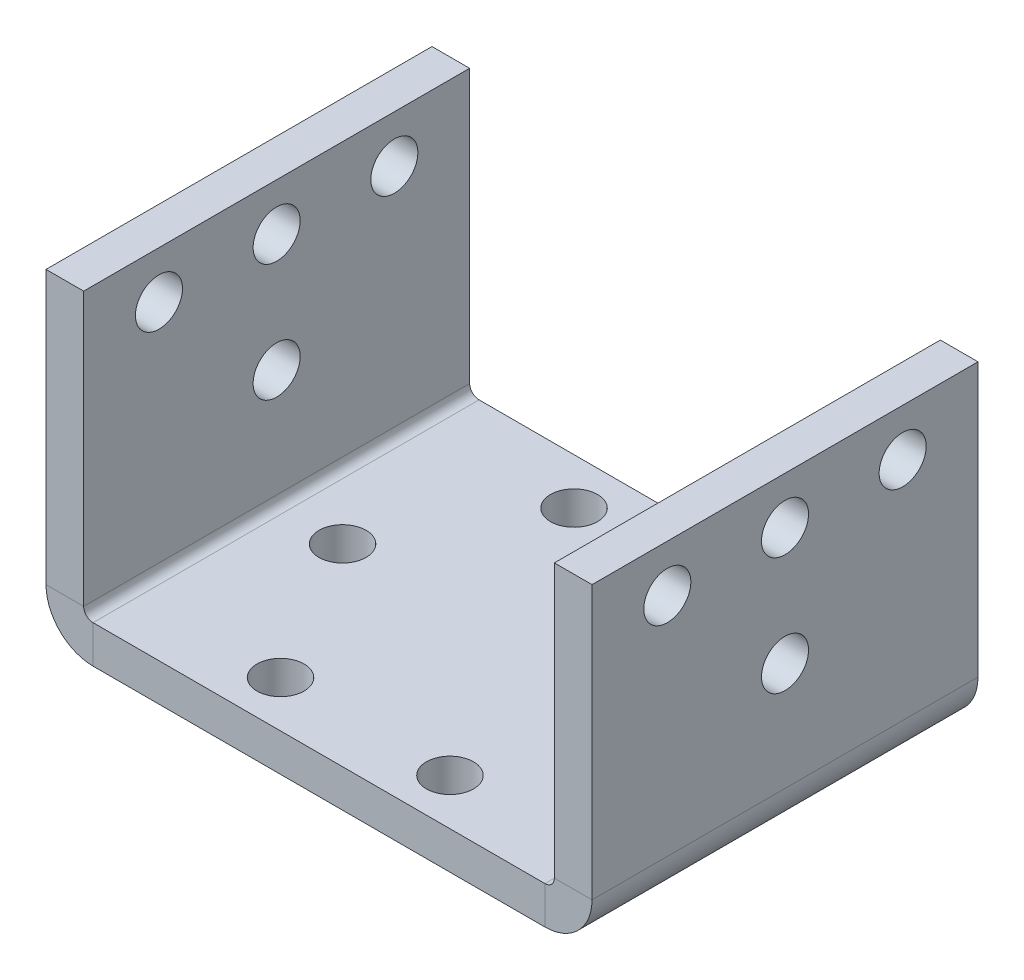
ISO-10303-21;
HEADER;
FILE_DESCRIPTION(('STEP AP214'),'2;1');
FILE_NAME('part.step','',(''),(''),'','','');
FILE_SCHEMA(('AUTOMOTIVE_DESIGN { 1 0 10303 214 1 1 1 1 }'));
ENDSEC;
DATA;
#1=APPLICATION_CONTEXT('core data for automotive mechanical design processes');
#2=APPLICATION_PROTOCOL_DEFINITION('international standard','automotive_design',2000,#1);
#3=PRODUCT_CONTEXT('',#1,'mechanical');
#4=PRODUCT('Part','Part','',(#3));
#5=PRODUCT_RELATED_PRODUCT_CATEGORY('part','',(#4));
#6=PRODUCT_DEFINITION_FORMATION('','',#4);
#7=PRODUCT_DEFINITION_CONTEXT('part definition',#1,'design');
#8=PRODUCT_DEFINITION('design','',#6,#7);
#9=PRODUCT_DEFINITION_SHAPE('','',#8);
#10=(LENGTH_UNIT() NAMED_UNIT(*) SI_UNIT(.MILLI.,.METRE.));
#11=(NAMED_UNIT(*) PLANE_ANGLE_UNIT() SI_UNIT($,.RADIAN.));
#12=(NAMED_UNIT(*) SI_UNIT($,.STERADIAN.) SOLID_ANGLE_UNIT());
#13=UNCERTAINTY_MEASURE_WITH_UNIT(LENGTH_MEASURE(1.E-05),#10,'distance_accuracy_value','');
#14=(GEOMETRIC_REPRESENTATION_CONTEXT(3) GLOBAL_UNCERTAINTY_ASSIGNED_CONTEXT((#13)) GLOBAL_UNIT_ASSIGNED_CONTEXT((#10,
#11,#12)) REPRESENTATION_CONTEXT('',''));
#15=CARTESIAN_POINT('',(0.,0.,0.));
#16=DIRECTION('',(0.,0.,1.));
#17=DIRECTION('',(1.,0.,0.));
#18=AXIS2_PLACEMENT_3D('',#15,#16,#17);
#19=CARTESIAN_POINT('',(25.,1.00000000000001,41.));
#20=DIRECTION('',(0.,0.,1.));
#21=DIRECTION('',(1.,0.,0.));
#22=AXIS2_PLACEMENT_3D('',#19,#20,#21);
#23=PLANE('',#22);
#24=DIRECTION('',(1.,0.,0.));
#25=VECTOR('',#24,1.);
#26=CARTESIAN_POINT('',(25.,1.00000000000001,41.));
#27=LINE('',#26,#25);
#28=CARTESIAN_POINT('',(25.,1.00000000000001,41.));
#29=VERTEX_POINT('',#28);
#30=CARTESIAN_POINT('',(29.,1.00000000000001,41.));
#31=VERTEX_POINT('',#30);
#32=EDGE_CURVE('E11',#29,#31,#27,.T.);
#33=ORIENTED_EDGE('',*,*,#32,.F.);
#34=CARTESIAN_POINT('',(24.,1.00000000000001,41.));
#35=DIRECTION('',(0.,0.,1.));
#36=DIRECTION('',(1.,0.,0.));
#37=AXIS2_PLACEMENT_3D('',#34,#35,#36);
#38=CIRCLE('',#37,1.);
#39=CARTESIAN_POINT('',(24.,0.,41.));
#40=VERTEX_POINT('',#39);
#41=EDGE_CURVE('E151',#29,#40,#38,.F.);
#42=ORIENTED_EDGE('',*,*,#41,.T.);
#43=DIRECTION('',(0.,1.,0.));
#44=VECTOR('',#43,1.);
#45=CARTESIAN_POINT('',(24.,-3.99999999999999,41.));
#46=LINE('',#45,#44);
#47=CARTESIAN_POINT('',(24.,-3.99999999999999,41.));
#48=VERTEX_POINT('',#47);
#49=EDGE_CURVE('E47',#48,#40,#46,.T.);
#50=ORIENTED_EDGE('',*,*,#49,.F.);
#51=CARTESIAN_POINT('',(24.,1.00000000000001,41.));
#52=DIRECTION('',(0.,0.,1.));
#53=DIRECTION('',(1.,0.,0.));
#54=AXIS2_PLACEMENT_3D('',#51,#52,#53);
#55=CIRCLE('',#54,5.);
#56=EDGE_CURVE('E320',#31,#48,#55,.F.);
#57=ORIENTED_EDGE('',*,*,#56,.F.);
#58=EDGE_LOOP('',(#33,#42,#50,#57));
#59=FACE_BOUND('',#58,.T.);
#60=ADVANCED_FACE('F38',(#59),#23,.T.);
#61=CARTESIAN_POINT('',(24.,-3.99999999999999,41.));
#62=DIRECTION('',(0.,0.,1.));
#63=DIRECTION('',(1.,0.,0.));
#64=AXIS2_PLACEMENT_3D('',#61,#62,#63);
#65=PLANE('',#64);
#66=DIRECTION('',(0.,-1.,0.));
#67=VECTOR('',#66,1.);
#68=CARTESIAN_POINT('',(25.,0.,41.));
#69=LINE('',#68,#67);
#70=CARTESIAN_POINT('',(25.,30.,41.));
#71=VERTEX_POINT('',#70);
#72=EDGE_CURVE('E156',#71,#29,#69,.T.);
#73=ORIENTED_EDGE('',*,*,#72,.T.);
#74=ORIENTED_EDGE('',*,*,#32,.T.);
#75=DIRECTION('',(0.,1.,0.));
#76=VECTOR('',#75,1.);
#77=CARTESIAN_POINT('',(29.,0.,41.));
#78=LINE('',#77,#76);
#79=CARTESIAN_POINT('',(29.,30.,41.));
#80=VERTEX_POINT('',#79);
#81=EDGE_CURVE('E322',#80,#31,#78,.F.);
#82=ORIENTED_EDGE('',*,*,#81,.F.);
#83=DIRECTION('',(1.,0.,0.));
#84=VECTOR('',#83,1.);
#85=CARTESIAN_POINT('',(25.,30.,41.));
#86=LINE('',#85,#84);
#87=EDGE_CURVE('E325',#71,#80,#86,.T.);
#88=ORIENTED_EDGE('',*,*,#87,.F.);
#89=EDGE_LOOP('',(#73,#74,#82,#88));
#90=FACE_BOUND('',#89,.T.);
#91=ADVANCED_FACE('F331',(#90),#65,.T.);
#92=CARTESIAN_POINT('',(24.,0.,0.));
#93=DIRECTION('',(0.,0.,-1.));
#94=DIRECTION('',(-1.,0.,0.));
#95=AXIS2_PLACEMENT_3D('',#92,#93,#94);
#96=PLANE('',#95);
#97=DIRECTION('',(0.,-1.,0.));
#98=VECTOR('',#97,1.);
#99=CARTESIAN_POINT('',(24.,0.,0.));
#100=LINE('',#99,#98);
#101=CARTESIAN_POINT('',(24.,0.,0.));
#102=VERTEX_POINT('',#101);
#103=CARTESIAN_POINT('',(24.,-3.99999999999999,0.));
#104=VERTEX_POINT('',#103);
#105=EDGE_CURVE('E148',#102,#104,#100,.T.);
#106=ORIENTED_EDGE('',*,*,#105,.F.);
#107=CARTESIAN_POINT('',(24.,1.00000000000001,0.));
#108=DIRECTION('',(0.,0.,1.));
#109=DIRECTION('',(1.,0.,0.));
#110=AXIS2_PLACEMENT_3D('',#107,#108,#109);
#111=CIRCLE('',#110,1.);
#112=CARTESIAN_POINT('',(25.,1.00000000000001,0.));
#113=VERTEX_POINT('',#112);
#114=EDGE_CURVE('E163',#113,#102,#111,.F.);
#115=ORIENTED_EDGE('',*,*,#114,.F.);
#116=DIRECTION('',(-1.,0.,0.));
#117=VECTOR('',#116,1.);
#118=CARTESIAN_POINT('',(29.,1.00000000000001,0.));
#119=LINE('',#118,#117);
#120=CARTESIAN_POINT('',(29.,1.00000000000001,0.));
#121=VERTEX_POINT('',#120);
#122=EDGE_CURVE('E237',#121,#113,#119,.T.);
#123=ORIENTED_EDGE('',*,*,#122,.F.);
#124=CARTESIAN_POINT('',(24.,1.00000000000001,0.));
#125=DIRECTION('',(0.,0.,1.));
#126=DIRECTION('',(1.,0.,0.));
#127=AXIS2_PLACEMENT_3D('',#124,#125,#126);
#128=CIRCLE('',#127,5.);
#129=EDGE_CURVE('E191',#121,#104,#128,.F.);
#130=ORIENTED_EDGE('',*,*,#129,.T.);
#131=EDGE_LOOP('',(#106,#115,#123,#130));
#132=FACE_BOUND('',#131,.T.);
#133=ADVANCED_FACE('F338',(#132),#96,.T.);
#134=CARTESIAN_POINT('',(29.,1.00000000000001,0.));
#135=DIRECTION('',(0.,0.,-1.));
#136=DIRECTION('',(-1.,0.,0.));
#137=AXIS2_PLACEMENT_3D('',#134,#135,#136);
#138=PLANE('',#137);
#139=DIRECTION('',(-1.,0.,0.));
#140=VECTOR('',#139,1.);
#141=CARTESIAN_POINT('',(-25.,0.,0.));
#142=LINE('',#141,#140);
#143=CARTESIAN_POINT('',(-24.,0.,0.));
#144=VERTEX_POINT('',#143);
#145=EDGE_CURVE('E204',#102,#144,#142,.T.);
#146=ORIENTED_EDGE('',*,*,#145,.F.);
#147=ORIENTED_EDGE('',*,*,#105,.T.);
#148=DIRECTION('',(-1.,0.,0.));
#149=VECTOR('',#148,1.);
#150=CARTESIAN_POINT('',(-25.,-4.,0.));
#151=LINE('',#150,#149);
#152=CARTESIAN_POINT('',(-24.,-4.,0.));
#153=VERTEX_POINT('',#152);
#154=EDGE_CURVE('E189',#104,#153,#151,.T.);
#155=ORIENTED_EDGE('',*,*,#154,.T.);
#156=DIRECTION('',(0.,1.,0.));
#157=VECTOR('',#156,1.);
#158=CARTESIAN_POINT('',(-24.,-4.,0.));
#159=LINE('',#158,#157);
#160=EDGE_CURVE('E97',#153,#144,#159,.T.);
#161=ORIENTED_EDGE('',*,*,#160,.T.);
#162=EDGE_LOOP('',(#146,#147,#155,#161));
#163=FACE_BOUND('',#162,.T.);
#164=ADVANCED_FACE('F340',(#163),#138,.T.);
#165=CARTESIAN_POINT('',(-24.,0.,41.));
#166=DIRECTION('',(0.,0.,1.));
#167=DIRECTION('',(1.,0.,0.));
#168=AXIS2_PLACEMENT_3D('',#165,#166,#167);
#169=PLANE('',#168);
#170=DIRECTION('',(0.,-1.,0.));
#171=VECTOR('',#170,1.);
#172=CARTESIAN_POINT('',(-24.,0.,41.));
#173=LINE('',#172,#171);
#174=CARTESIAN_POINT('',(-24.,0.,41.));
#175=VERTEX_POINT('',#174);
#176=CARTESIAN_POINT('',(-24.,-4.,41.));
#177=VERTEX_POINT('',#176);
#178=EDGE_CURVE('E235',#175,#177,#173,.T.);
#179=ORIENTED_EDGE('',*,*,#178,.F.);
#180=CARTESIAN_POINT('',(-24.,1.,41.));
#181=DIRECTION('',(0.,0.,1.));
#182=DIRECTION('',(1.,0.,0.));
#183=AXIS2_PLACEMENT_3D('',#180,#181,#182);
#184=CIRCLE('',#183,1.);
#185=CARTESIAN_POINT('',(-25.,1.,41.));
#186=VERTEX_POINT('',#185);
#187=EDGE_CURVE('E171',#175,#186,#184,.F.);
#188=ORIENTED_EDGE('',*,*,#187,.T.);
#189=DIRECTION('',(1.,0.,0.));
#190=VECTOR('',#189,1.);
#191=CARTESIAN_POINT('',(-29.,1.,41.));
#192=LINE('',#191,#190);
#193=CARTESIAN_POINT('',(-29.,1.,41.));
#194=VERTEX_POINT('',#193);
#195=EDGE_CURVE('E56',#194,#186,#192,.T.);
#196=ORIENTED_EDGE('',*,*,#195,.F.);
#197=CARTESIAN_POINT('',(-24.,1.,41.));
#198=DIRECTION('',(0.,0.,1.));
#199=DIRECTION('',(1.,0.,0.));
#200=AXIS2_PLACEMENT_3D('',#197,#198,#199);
#201=CIRCLE('',#200,5.);
#202=EDGE_CURVE('E316',#177,#194,#201,.F.);
#203=ORIENTED_EDGE('',*,*,#202,.F.);
#204=EDGE_LOOP('',(#179,#188,#196,#203));
#205=FACE_BOUND('',#204,.T.);
#206=ADVANCED_FACE('F390',(#205),#169,.T.);
#207=CARTESIAN_POINT('',(-29.,1.,41.));
#208=DIRECTION('',(0.,0.,1.));
#209=DIRECTION('',(1.,0.,0.));
#210=AXIS2_PLACEMENT_3D('',#207,#208,#209);
#211=PLANE('',#210);
#212=DIRECTION('',(-1.,0.,0.));
#213=VECTOR('',#212,1.);
#214=CARTESIAN_POINT('',(-25.,0.,41.));
#215=LINE('',#214,#213);
#216=EDGE_CURVE('E140',#40,#175,#215,.T.);
#217=ORIENTED_EDGE('',*,*,#216,.T.);
#218=ORIENTED_EDGE('',*,*,#178,.T.);
#219=DIRECTION('',(-1.,0.,0.));
#220=VECTOR('',#219,1.);
#221=CARTESIAN_POINT('',(-25.,-4.,41.));
#222=LINE('',#221,#220);
#223=EDGE_CURVE('E143',#48,#177,#222,.T.);
#224=ORIENTED_EDGE('',*,*,#223,.F.);
#225=ORIENTED_EDGE('',*,*,#49,.T.);
#226=EDGE_LOOP('',(#217,#218,#224,#225));
#227=FACE_BOUND('',#226,.T.);
#228=ADVANCED_FACE('F138',(#227),#211,.T.);
#229=CARTESIAN_POINT('',(-25.,1.,0.));
#230=DIRECTION('',(0.,0.,-1.));
#231=DIRECTION('',(-1.,0.,0.));
#232=AXIS2_PLACEMENT_3D('',#229,#230,#231);
#233=PLANE('',#232);
#234=DIRECTION('',(-1.,0.,0.));
#235=VECTOR('',#234,1.);
#236=CARTESIAN_POINT('',(-25.,1.,0.));
#237=LINE('',#236,#235);
#238=CARTESIAN_POINT('',(-25.,1.,0.));
#239=VERTEX_POINT('',#238);
#240=CARTESIAN_POINT('',(-29.,1.,0.));
#241=VERTEX_POINT('',#240);
#242=EDGE_CURVE('E104',#239,#241,#237,.T.);
#243=ORIENTED_EDGE('',*,*,#242,.F.);
#244=CARTESIAN_POINT('',(-24.,1.,0.));
#245=DIRECTION('',(0.,0.,1.));
#246=DIRECTION('',(1.,0.,0.));
#247=AXIS2_PLACEMENT_3D('',#244,#245,#246);
#248=CIRCLE('',#247,1.);
#249=EDGE_CURVE('E206',#144,#239,#248,.F.);
#250=ORIENTED_EDGE('',*,*,#249,.F.);
#251=ORIENTED_EDGE('',*,*,#160,.F.);
#252=CARTESIAN_POINT('',(-24.,1.,0.));
#253=DIRECTION('',(0.,0.,1.));
#254=DIRECTION('',(1.,0.,0.));
#255=AXIS2_PLACEMENT_3D('',#252,#253,#254);
#256=CIRCLE('',#255,5.);
#257=EDGE_CURVE('E187',#153,#241,#256,.F.);
#258=ORIENTED_EDGE('',*,*,#257,.T.);
#259=EDGE_LOOP('',(#243,#250,#251,#258));
#260=FACE_BOUND('',#259,.T.);
#261=ADVANCED_FACE('F353',(#260),#233,.T.);
#262=CARTESIAN_POINT('',(-24.,-4.,0.));
#263=DIRECTION('',(0.,0.,-1.));
#264=DIRECTION('',(-1.,0.,0.));
#265=AXIS2_PLACEMENT_3D('',#262,#263,#264);
#266=PLANE('',#265);
#267=DIRECTION('',(0.,1.,0.));
#268=VECTOR('',#267,1.);
#269=CARTESIAN_POINT('',(-25.,0.,0.));
#270=LINE('',#269,#268);
#271=CARTESIAN_POINT('',(-25.,30.,0.));
#272=VERTEX_POINT('',#271);
#273=EDGE_CURVE('E177',#239,#272,#270,.T.);
#274=ORIENTED_EDGE('',*,*,#273,.F.);
#275=ORIENTED_EDGE('',*,*,#242,.T.);
#276=DIRECTION('',(0.,1.,0.));
#277=VECTOR('',#276,1.);
#278=CARTESIAN_POINT('',(-29.,0.,0.));
#279=LINE('',#278,#277);
#280=CARTESIAN_POINT('',(-29.,30.,0.));
#281=VERTEX_POINT('',#280);
#282=EDGE_CURVE('E184',#241,#281,#279,.T.);
#283=ORIENTED_EDGE('',*,*,#282,.T.);
#284=DIRECTION('',(1.,0.,0.));
#285=VECTOR('',#284,1.);
#286=CARTESIAN_POINT('',(-29.,30.,0.));
#287=LINE('',#286,#285);
#288=EDGE_CURVE('E180',#281,#272,#287,.T.);
#289=ORIENTED_EDGE('',*,*,#288,.T.);
#290=EDGE_LOOP('',(#274,#275,#283,#289));
#291=FACE_BOUND('',#290,.T.);
#292=ADVANCED_FACE('F361',(#291),#266,.T.);
#293=CARTESIAN_POINT('',(-25.,0.,41.));
#294=DIRECTION('',(-1.,0.,0.));
#295=DIRECTION('',(0.,0.,1.));
#296=AXIS2_PLACEMENT_3D('',#293,#294,#295);
#297=PLANE('',#296);
#298=CARTESIAN_POINT('',(-25.,12.5,20.5));
#299=DIRECTION('',(-1.,0.,0.));
#300=DIRECTION('',(0.,0.,1.));
#301=AXIS2_PLACEMENT_3D('',#298,#299,#300);
#302=CIRCLE('',#301,2.5);
#303=CARTESIAN_POINT('',(-25.,12.5,23.));
#304=VERTEX_POINT('',#303);
#305=EDGE_CURVE('E289',#304,#304,#302,.T.);
#306=ORIENTED_EDGE('',*,*,#305,.T.);
#307=EDGE_LOOP('',(#306));
#308=FACE_BOUND('',#307,.T.);
#309=CARTESIAN_POINT('',(-25.,25.,33.));
#310=DIRECTION('',(-1.,0.,0.));
#311=DIRECTION('',(0.,0.,1.));
#312=AXIS2_PLACEMENT_3D('',#309,#310,#311);
#313=CIRCLE('',#312,2.5);
#314=CARTESIAN_POINT('',(-25.,25.,35.5));
#315=VERTEX_POINT('',#314);
#316=EDGE_CURVE('E274',#315,#315,#313,.T.);
#317=ORIENTED_EDGE('',*,*,#316,.T.);
#318=EDGE_LOOP('',(#317));
#319=FACE_BOUND('',#318,.T.);
#320=CARTESIAN_POINT('',(-25.,25.,20.5));
#321=DIRECTION('',(-1.,0.,0.));
#322=DIRECTION('',(0.,0.,1.));
#323=AXIS2_PLACEMENT_3D('',#320,#321,#322);
#324=CIRCLE('',#323,2.5);
#325=CARTESIAN_POINT('',(-25.,25.,23.));
#326=VERTEX_POINT('',#325);
#327=EDGE_CURVE('E270',#326,#326,#324,.T.);
#328=ORIENTED_EDGE('',*,*,#327,.T.);
#329=EDGE_LOOP('',(#328));
#330=FACE_BOUND('',#329,.T.);
#331=CARTESIAN_POINT('',(-25.,25.,8.));
#332=DIRECTION('',(-1.,0.,0.));
#333=DIRECTION('',(0.,0.,1.));
#334=AXIS2_PLACEMENT_3D('',#331,#332,#333);
#335=CIRCLE('',#334,2.5);
#336=CARTESIAN_POINT('',(-25.,25.,10.5));
#337=VERTEX_POINT('',#336);
#338=EDGE_CURVE('E266',#337,#337,#335,.T.);
#339=ORIENTED_EDGE('',*,*,#338,.T.);
#340=EDGE_LOOP('',(#339));
#341=FACE_BOUND('',#340,.T.);
#342=ORIENTED_EDGE('',*,*,#273,.T.);
#343=DIRECTION('',(0.,0.,-1.));
#344=VECTOR('',#343,1.);
#345=CARTESIAN_POINT('',(-25.,30.,41.));
#346=LINE('',#345,#344);
#347=CARTESIAN_POINT('',(-25.,30.,41.));
#348=VERTEX_POINT('',#347);
#349=EDGE_CURVE('E230',#348,#272,#346,.T.);
#350=ORIENTED_EDGE('',*,*,#349,.F.);
#351=DIRECTION('',(0.,1.,0.));
#352=VECTOR('',#351,1.);
#353=CARTESIAN_POINT('',(-25.,0.,41.));
#354=LINE('',#353,#352);
#355=EDGE_CURVE('E110',#186,#348,#354,.T.);
#356=ORIENTED_EDGE('',*,*,#355,.F.);
#357=DIRECTION('',(0.,0.,-1.));
#358=VECTOR('',#357,1.);
#359=CARTESIAN_POINT('',(-25.,1.,41.));
#360=LINE('',#359,#358);
#361=EDGE_CURVE('E173',#186,#239,#360,.T.);
#362=ORIENTED_EDGE('',*,*,#361,.T.);
#363=EDGE_LOOP('',(#342,#350,#356,#362));
#364=FACE_BOUND('',#363,.T.);
#365=ADVANCED_FACE('F359',(#308,#319,#330,#341,#364),#297,.F.);
#366=CARTESIAN_POINT('',(-29.,30.,41.));
#367=DIRECTION('',(0.,1.,0.));
#368=DIRECTION('',(0.,0.,1.));
#369=AXIS2_PLACEMENT_3D('',#366,#367,#368);
#370=PLANE('',#369);
#371=ORIENTED_EDGE('',*,*,#288,.F.);
#372=DIRECTION('',(0.,0.,-1.));
#373=VECTOR('',#372,1.);
#374=CARTESIAN_POINT('',(-29.,30.,41.));
#375=LINE('',#374,#373);
#376=CARTESIAN_POINT('',(-29.,30.,41.));
#377=VERTEX_POINT('',#376);
#378=EDGE_CURVE('E228',#377,#281,#375,.T.);
#379=ORIENTED_EDGE('',*,*,#378,.F.);
#380=DIRECTION('',(1.,0.,0.));
#381=VECTOR('',#380,1.);
#382=CARTESIAN_POINT('',(-29.,30.,41.));
#383=LINE('',#382,#381);
#384=EDGE_CURVE('E310',#377,#348,#383,.T.);
#385=ORIENTED_EDGE('',*,*,#384,.T.);
#386=ORIENTED_EDGE('',*,*,#349,.T.);
#387=EDGE_LOOP('',(#371,#379,#385,#386));
#388=FACE_BOUND('',#387,.T.);
#389=ADVANCED_FACE('F364',(#388),#370,.T.);
#390=CARTESIAN_POINT('',(-29.,0.,41.));
#391=DIRECTION('',(-1.,0.,0.));
#392=DIRECTION('',(0.,0.,1.));
#393=AXIS2_PLACEMENT_3D('',#390,#391,#392);
#394=PLANE('',#393);
#395=CARTESIAN_POINT('',(-29.,12.5,20.5));
#396=DIRECTION('',(1.,0.,0.));
#397=DIRECTION('',(0.,0.,-1.));
#398=AXIS2_PLACEMENT_3D('',#395,#396,#397);
#399=CIRCLE('',#398,2.5);
#400=CARTESIAN_POINT('',(-29.,12.5,18.));
#401=VERTEX_POINT('',#400);
#402=EDGE_CURVE('E262',#401,#401,#399,.T.);
#403=ORIENTED_EDGE('',*,*,#402,.T.);
#404=EDGE_LOOP('',(#403));
#405=FACE_BOUND('',#404,.T.);
#406=CARTESIAN_POINT('',(-29.,25.,33.));
#407=DIRECTION('',(1.,0.,0.));
#408=DIRECTION('',(0.,0.,-1.));
#409=AXIS2_PLACEMENT_3D('',#406,#407,#408);
#410=CIRCLE('',#409,2.5);
#411=CARTESIAN_POINT('',(-29.,25.,30.5));
#412=VERTEX_POINT('',#411);
#413=EDGE_CURVE('E420',#412,#412,#410,.T.);
#414=ORIENTED_EDGE('',*,*,#413,.T.);
#415=EDGE_LOOP('',(#414));
#416=FACE_BOUND('',#415,.T.);
#417=CARTESIAN_POINT('',(-29.,25.,20.5));
#418=DIRECTION('',(1.,0.,0.));
#419=DIRECTION('',(0.,0.,-1.));
#420=AXIS2_PLACEMENT_3D('',#417,#418,#419);
#421=CIRCLE('',#420,2.5);
#422=CARTESIAN_POINT('',(-29.,25.,18.));
#423=VERTEX_POINT('',#422);
#424=EDGE_CURVE('E417',#423,#423,#421,.T.);
#425=ORIENTED_EDGE('',*,*,#424,.T.);
#426=EDGE_LOOP('',(#425));
#427=FACE_BOUND('',#426,.T.);
#428=CARTESIAN_POINT('',(-29.,25.,8.));
#429=DIRECTION('',(1.,0.,0.));
#430=DIRECTION('',(0.,0.,-1.));
#431=AXIS2_PLACEMENT_3D('',#428,#429,#430);
#432=CIRCLE('',#431,2.5);
#433=CARTESIAN_POINT('',(-29.,25.,5.5));
#434=VERTEX_POINT('',#433);
#435=EDGE_CURVE('E414',#434,#434,#432,.T.);
#436=ORIENTED_EDGE('',*,*,#435,.T.);
#437=EDGE_LOOP('',(#436));
#438=FACE_BOUND('',#437,.T.);
#439=ORIENTED_EDGE('',*,*,#282,.F.);
#440=DIRECTION('',(0.,0.,-1.));
#441=VECTOR('',#440,1.);
#442=CARTESIAN_POINT('',(-29.,1.,41.));
#443=LINE('',#442,#441);
#444=EDGE_CURVE('E225',#194,#241,#443,.T.);
#445=ORIENTED_EDGE('',*,*,#444,.F.);
#446=DIRECTION('',(0.,1.,0.));
#447=VECTOR('',#446,1.);
#448=CARTESIAN_POINT('',(-29.,0.,41.));
#449=LINE('',#448,#447);
#450=EDGE_CURVE('E313',#194,#377,#449,.T.);
#451=ORIENTED_EDGE('',*,*,#450,.T.);
#452=ORIENTED_EDGE('',*,*,#378,.T.);
#453=EDGE_LOOP('',(#439,#445,#451,#452));
#454=FACE_BOUND('',#453,.T.);
#455=ADVANCED_FACE('F367',(#405,#416,#427,#438,#454),#394,.T.);
#456=CARTESIAN_POINT('',(-24.,1.,41.));
#457=DIRECTION('',(0.,0.,-1.));
#458=DIRECTION('',(-1.,0.,0.));
#459=AXIS2_PLACEMENT_3D('',#456,#457,#458);
#460=CYLINDRICAL_SURFACE('',#459,5.);
#461=ORIENTED_EDGE('',*,*,#257,.F.);
#462=DIRECTION('',(0.,0.,-1.));
#463=VECTOR('',#462,1.);
#464=CARTESIAN_POINT('',(-24.,-4.,41.));
#465=LINE('',#464,#463);
#466=EDGE_CURVE('E222',#177,#153,#465,.T.);
#467=ORIENTED_EDGE('',*,*,#466,.F.);
#468=ORIENTED_EDGE('',*,*,#202,.T.);
#469=ORIENTED_EDGE('',*,*,#444,.T.);
#470=EDGE_LOOP('',(#461,#467,#468,#469));
#471=FACE_BOUND('',#470,.T.);
#472=ADVANCED_FACE('F350',(#471),#460,.T.);
#473=CARTESIAN_POINT('',(-25.,-4.,41.));
#474=DIRECTION('',(0.,-1.,0.));
#475=DIRECTION('',(1.,0.,0.));
#476=AXIS2_PLACEMENT_3D('',#473,#474,#475);
#477=PLANE('',#476);
#478=CARTESIAN_POINT('',(-18.,-4.,20.5));
#479=DIRECTION('',(0.,-1.,0.));
#480=DIRECTION('',(1.,0.,0.));
#481=AXIS2_PLACEMENT_3D('',#478,#479,#480);
#482=CIRCLE('',#481,2.49999999999999);
#483=CARTESIAN_POINT('',(-15.5,-4.,20.5));
#484=VERTEX_POINT('',#483);
#485=EDGE_CURVE('E244',#484,#484,#482,.T.);
#486=ORIENTED_EDGE('',*,*,#485,.F.);
#487=EDGE_LOOP('',(#486));
#488=FACE_BOUND('',#487,.T.);
#489=CARTESIAN_POINT('',(8.99999999999999,-3.99999999999999,36.0884572681199));
#490=DIRECTION('',(0.,-1.,0.));
#491=DIRECTION('',(1.,0.,0.));
#492=AXIS2_PLACEMENT_3D('',#489,#490,#491);
#493=CIRCLE('',#492,2.5);
#494=CARTESIAN_POINT('',(11.5,-3.99999999999999,36.0884572681199));
#495=VERTEX_POINT('',#494);
#496=EDGE_CURVE('E292',#495,#495,#493,.T.);
#497=ORIENTED_EDGE('',*,*,#496,.F.);
#498=EDGE_LOOP('',(#497));
#499=FACE_BOUND('',#498,.T.);
#500=CARTESIAN_POINT('',(-8.99999999999999,-4.,4.91154273188009));
#501=DIRECTION('',(0.,-1.,0.));
#502=DIRECTION('',(1.,0.,0.));
#503=AXIS2_PLACEMENT_3D('',#500,#501,#502);
#504=CIRCLE('',#503,2.5);
#505=CARTESIAN_POINT('',(-6.49999999999999,-4.,4.91154273188009));
#506=VERTEX_POINT('',#505);
#507=EDGE_CURVE('E298',#506,#506,#504,.T.);
#508=ORIENTED_EDGE('',*,*,#507,.F.);
#509=EDGE_LOOP('',(#508));
#510=FACE_BOUND('',#509,.T.);
#511=CARTESIAN_POINT('',(9.00000000000001,-3.99999999999999,4.91154273188011));
#512=DIRECTION('',(0.,-1.,0.));
#513=DIRECTION('',(1.,0.,0.));
#514=AXIS2_PLACEMENT_3D('',#511,#512,#513);
#515=CIRCLE('',#514,2.5);
#516=CARTESIAN_POINT('',(11.5,-3.99999999999999,4.91154273188011));
#517=VERTEX_POINT('',#516);
#518=EDGE_CURVE('E304',#517,#517,#515,.T.);
#519=ORIENTED_EDGE('',*,*,#518,.F.);
#520=EDGE_LOOP('',(#519));
#521=FACE_BOUND('',#520,.T.);
#522=CARTESIAN_POINT('',(18.,-3.99999999999999,20.5));
#523=DIRECTION('',(0.,-1.,0.));
#524=DIRECTION('',(1.,0.,0.));
#525=AXIS2_PLACEMENT_3D('',#522,#523,#524);
#526=CIRCLE('',#525,2.5);
#527=CARTESIAN_POINT('',(20.5,-3.99999999999999,20.5));
#528=VERTEX_POINT('',#527);
#529=EDGE_CURVE('E301',#528,#528,#526,.T.);
#530=ORIENTED_EDGE('',*,*,#529,.F.);
#531=EDGE_LOOP('',(#530));
#532=FACE_BOUND('',#531,.T.);
#533=CARTESIAN_POINT('',(-9.00000000000001,-4.,36.0884572681199));
#534=DIRECTION('',(0.,-1.,0.));
#535=DIRECTION('',(1.,0.,0.));
#536=AXIS2_PLACEMENT_3D('',#533,#534,#535);
#537=CIRCLE('',#536,2.5);
#538=CARTESIAN_POINT('',(-6.5,-4.,36.0884572681199));
#539=VERTEX_POINT('',#538);
#540=EDGE_CURVE('E295',#539,#539,#537,.T.);
#541=ORIENTED_EDGE('',*,*,#540,.F.);
#542=EDGE_LOOP('',(#541));
#543=FACE_BOUND('',#542,.T.);
#544=ORIENTED_EDGE('',*,*,#154,.F.);
#545=DIRECTION('',(0.,0.,-1.));
#546=VECTOR('',#545,1.);
#547=CARTESIAN_POINT('',(24.,-3.99999999999999,41.));
#548=LINE('',#547,#546);
#549=EDGE_CURVE('E219',#48,#104,#548,.T.);
#550=ORIENTED_EDGE('',*,*,#549,.F.);
#551=ORIENTED_EDGE('',*,*,#223,.T.);
#552=ORIENTED_EDGE('',*,*,#466,.T.);
#553=EDGE_LOOP('',(#544,#550,#551,#552));
#554=FACE_BOUND('',#553,.T.);
#555=ADVANCED_FACE('F345',(#488,#499,#510,#521,#532,#543,#554),#477,.T.);
#556=CARTESIAN_POINT('',(24.,1.00000000000001,41.));
#557=DIRECTION('',(0.,0.,-1.));
#558=DIRECTION('',(-1.,0.,0.));
#559=AXIS2_PLACEMENT_3D('',#556,#557,#558);
#560=CYLINDRICAL_SURFACE('',#559,5.);
#561=ORIENTED_EDGE('',*,*,#129,.F.);
#562=DIRECTION('',(0.,0.,-1.));
#563=VECTOR('',#562,1.);
#564=CARTESIAN_POINT('',(29.,1.00000000000001,41.));
#565=LINE('',#564,#563);
#566=EDGE_CURVE('E216',#31,#121,#565,.T.);
#567=ORIENTED_EDGE('',*,*,#566,.F.);
#568=ORIENTED_EDGE('',*,*,#56,.T.);
#569=ORIENTED_EDGE('',*,*,#549,.T.);
#570=EDGE_LOOP('',(#561,#567,#568,#569));
#571=FACE_BOUND('',#570,.T.);
#572=ADVANCED_FACE('F343',(#571),#560,.T.);
#573=CARTESIAN_POINT('',(29.,0.,41.));
#574=DIRECTION('',(1.,0.,0.));
#575=DIRECTION('',(0.,0.,-1.));
#576=AXIS2_PLACEMENT_3D('',#573,#574,#575);
#577=PLANE('',#576);
#578=CARTESIAN_POINT('',(29.,12.5,20.5));
#579=DIRECTION('',(1.,0.,0.));
#580=DIRECTION('',(0.,0.,-1.));
#581=AXIS2_PLACEMENT_3D('',#578,#579,#580);
#582=CIRCLE('',#581,2.5);
#583=CARTESIAN_POINT('',(29.,12.5,18.));
#584=VERTEX_POINT('',#583);
#585=EDGE_CURVE('E286',#584,#584,#582,.T.);
#586=ORIENTED_EDGE('',*,*,#585,.F.);
#587=EDGE_LOOP('',(#586));
#588=FACE_BOUND('',#587,.T.);
#589=CARTESIAN_POINT('',(29.,25.,33.));
#590=DIRECTION('',(1.,0.,0.));
#591=DIRECTION('',(0.,0.,-1.));
#592=AXIS2_PLACEMENT_3D('',#589,#590,#591);
#593=CIRCLE('',#592,2.5);
#594=CARTESIAN_POINT('',(29.,25.,30.5));
#595=VERTEX_POINT('',#594);
#596=EDGE_CURVE('E269',#595,#595,#593,.T.);
#597=ORIENTED_EDGE('',*,*,#596,.F.);
#598=EDGE_LOOP('',(#597));
#599=FACE_BOUND('',#598,.T.);
#600=CARTESIAN_POINT('',(29.,25.,20.5));
#601=DIRECTION('',(1.,0.,0.));
#602=DIRECTION('',(0.,0.,-1.));
#603=AXIS2_PLACEMENT_3D('',#600,#601,#602);
#604=CIRCLE('',#603,2.5);
#605=CARTESIAN_POINT('',(29.,25.,18.));
#606=VERTEX_POINT('',#605);
#607=EDGE_CURVE('E265',#606,#606,#604,.T.);
#608=ORIENTED_EDGE('',*,*,#607,.F.);
#609=EDGE_LOOP('',(#608));
#610=FACE_BOUND('',#609,.T.);
#611=CARTESIAN_POINT('',(29.,25.,8.));
#612=DIRECTION('',(1.,0.,0.));
#613=DIRECTION('',(0.,0.,-1.));
#614=AXIS2_PLACEMENT_3D('',#611,#612,#613);
#615=CIRCLE('',#614,2.5);
#616=CARTESIAN_POINT('',(29.,25.,5.5));
#617=VERTEX_POINT('',#616);
#618=EDGE_CURVE('E261',#617,#617,#615,.T.);
#619=ORIENTED_EDGE('',*,*,#618,.F.);
#620=EDGE_LOOP('',(#619));
#621=FACE_BOUND('',#620,.T.);
#622=DIRECTION('',(0.,1.,0.));
#623=VECTOR('',#622,1.);
#624=CARTESIAN_POINT('',(29.,0.,0.));
#625=LINE('',#624,#623);
#626=CARTESIAN_POINT('',(29.,30.,0.));
#627=VERTEX_POINT('',#626);
#628=EDGE_CURVE('E194',#627,#121,#625,.F.);
#629=ORIENTED_EDGE('',*,*,#628,.F.);
#630=DIRECTION('',(0.,0.,-1.));
#631=VECTOR('',#630,1.);
#632=CARTESIAN_POINT('',(29.,30.,41.));
#633=LINE('',#632,#631);
#634=EDGE_CURVE('E214',#80,#627,#633,.T.);
#635=ORIENTED_EDGE('',*,*,#634,.F.);
#636=ORIENTED_EDGE('',*,*,#81,.T.);
#637=ORIENTED_EDGE('',*,*,#566,.T.);
#638=EDGE_LOOP('',(#629,#635,#636,#637));
#639=FACE_BOUND('',#638,.T.);
#640=ADVANCED_FACE('F510',(#588,#599,#610,#621,#639),#577,.T.);
#641=CARTESIAN_POINT('',(25.,30.,41.));
#642=DIRECTION('',(0.,1.,0.));
#643=DIRECTION('',(0.,0.,1.));
#644=AXIS2_PLACEMENT_3D('',#641,#642,#643);
#645=PLANE('',#644);
#646=DIRECTION('',(1.,0.,0.));
#647=VECTOR('',#646,1.);
#648=CARTESIAN_POINT('',(25.,30.,0.));
#649=LINE('',#648,#647);
#650=CARTESIAN_POINT('',(25.,30.,0.));
#651=VERTEX_POINT('',#650);
#652=EDGE_CURVE('E197',#651,#627,#649,.T.);
#653=ORIENTED_EDGE('',*,*,#652,.F.);
#654=DIRECTION('',(0.,0.,-1.));
#655=VECTOR('',#654,1.);
#656=CARTESIAN_POINT('',(25.,30.,41.));
#657=LINE('',#656,#655);
#658=EDGE_CURVE('E212',#71,#651,#657,.T.);
#659=ORIENTED_EDGE('',*,*,#658,.F.);
#660=ORIENTED_EDGE('',*,*,#87,.T.);
#661=ORIENTED_EDGE('',*,*,#634,.T.);
#662=EDGE_LOOP('',(#653,#659,#660,#661));
#663=FACE_BOUND('',#662,.T.);
#664=ADVANCED_FACE('F456',(#663),#645,.T.);
#665=CARTESIAN_POINT('',(25.,0.,41.));
#666=DIRECTION('',(1.,0.,0.));
#667=DIRECTION('',(0.,0.,-1.));
#668=AXIS2_PLACEMENT_3D('',#665,#666,#667);
#669=PLANE('',#668);
#670=CARTESIAN_POINT('',(25.,12.5,20.5));
#671=DIRECTION('',(1.,0.,0.));
#672=DIRECTION('',(0.,0.,-1.));
#673=AXIS2_PLACEMENT_3D('',#670,#671,#672);
#674=CIRCLE('',#673,2.5);
#675=CARTESIAN_POINT('',(25.,12.5,18.));
#676=VERTEX_POINT('',#675);
#677=EDGE_CURVE('E41',#676,#676,#674,.T.);
#678=ORIENTED_EDGE('',*,*,#677,.T.);
#679=EDGE_LOOP('',(#678));
#680=FACE_BOUND('',#679,.T.);
#681=CARTESIAN_POINT('',(25.,25.,33.));
#682=DIRECTION('',(1.,0.,0.));
#683=DIRECTION('',(0.,0.,-1.));
#684=AXIS2_PLACEMENT_3D('',#681,#682,#683);
#685=CIRCLE('',#684,2.5);
#686=CARTESIAN_POINT('',(25.,25.,30.5));
#687=VERTEX_POINT('',#686);
#688=EDGE_CURVE('E267',#687,#687,#685,.T.);
#689=ORIENTED_EDGE('',*,*,#688,.T.);
#690=EDGE_LOOP('',(#689));
#691=FACE_BOUND('',#690,.T.);
#692=CARTESIAN_POINT('',(25.,25.,20.5));
#693=DIRECTION('',(1.,0.,0.));
#694=DIRECTION('',(0.,0.,-1.));
#695=AXIS2_PLACEMENT_3D('',#692,#693,#694);
#696=CIRCLE('',#695,2.5);
#697=CARTESIAN_POINT('',(25.,25.,18.));
#698=VERTEX_POINT('',#697);
#699=EDGE_CURVE('E263',#698,#698,#696,.T.);
#700=ORIENTED_EDGE('',*,*,#699,.T.);
#701=EDGE_LOOP('',(#700));
#702=FACE_BOUND('',#701,.T.);
#703=CARTESIAN_POINT('',(25.,25.,8.));
#704=DIRECTION('',(1.,0.,0.));
#705=DIRECTION('',(0.,0.,-1.));
#706=AXIS2_PLACEMENT_3D('',#703,#704,#705);
#707=CIRCLE('',#706,2.5);
#708=CARTESIAN_POINT('',(25.,25.,5.5));
#709=VERTEX_POINT('',#708);
#710=EDGE_CURVE('E258',#709,#709,#707,.T.);
#711=ORIENTED_EDGE('',*,*,#710,.T.);
#712=EDGE_LOOP('',(#711));
#713=FACE_BOUND('',#712,.T.);
#714=DIRECTION('',(0.,-1.,0.));
#715=VECTOR('',#714,1.);
#716=CARTESIAN_POINT('',(25.,0.,0.));
#717=LINE('',#716,#715);
#718=EDGE_CURVE('E200',#651,#113,#717,.T.);
#719=ORIENTED_EDGE('',*,*,#718,.T.);
#720=DIRECTION('',(0.,0.,-1.));
#721=VECTOR('',#720,1.);
#722=CARTESIAN_POINT('',(25.,1.00000000000001,41.));
#723=LINE('',#722,#721);
#724=EDGE_CURVE('E165',#29,#113,#723,.T.);
#725=ORIENTED_EDGE('',*,*,#724,.F.);
#726=ORIENTED_EDGE('',*,*,#72,.F.);
#727=ORIENTED_EDGE('',*,*,#658,.T.);
#728=EDGE_LOOP('',(#719,#725,#726,#727));
#729=FACE_BOUND('',#728,.T.);
#730=ADVANCED_FACE('F335',(#680,#691,#702,#713,#729),#669,.F.);
#731=CARTESIAN_POINT('',(24.,1.00000000000001,41.));
#732=DIRECTION('',(0.,0.,-1.));
#733=DIRECTION('',(-1.,0.,0.));
#734=AXIS2_PLACEMENT_3D('',#731,#732,#733);
#735=CYLINDRICAL_SURFACE('',#734,1.);
#736=ORIENTED_EDGE('',*,*,#114,.T.);
#737=DIRECTION('',(0.,0.,-1.));
#738=VECTOR('',#737,1.);
#739=CARTESIAN_POINT('',(24.,0.,41.));
#740=LINE('',#739,#738);
#741=EDGE_CURVE('E160',#40,#102,#740,.T.);
#742=ORIENTED_EDGE('',*,*,#741,.F.);
#743=ORIENTED_EDGE('',*,*,#41,.F.);
#744=ORIENTED_EDGE('',*,*,#724,.T.);
#745=EDGE_LOOP('',(#736,#742,#743,#744));
#746=FACE_BOUND('',#745,.T.);
#747=ADVANCED_FACE('F161',(#746),#735,.F.);
#748=CARTESIAN_POINT('',(-25.,0.,41.));
#749=DIRECTION('',(0.,-1.,0.));
#750=DIRECTION('',(1.,0.,0.));
#751=AXIS2_PLACEMENT_3D('',#748,#749,#750);
#752=PLANE('',#751);
#753=CARTESIAN_POINT('',(-18.,0.,20.5));
#754=DIRECTION('',(0.,-1.,0.));
#755=DIRECTION('',(1.,0.,0.));
#756=AXIS2_PLACEMENT_3D('',#753,#754,#755);
#757=CIRCLE('',#756,2.49999999999999);
#758=CARTESIAN_POINT('',(-15.5,0.,20.5));
#759=VERTEX_POINT('',#758);
#760=EDGE_CURVE('E181',#759,#759,#757,.T.);
#761=ORIENTED_EDGE('',*,*,#760,.T.);
#762=EDGE_LOOP('',(#761));
#763=FACE_BOUND('',#762,.T.);
#764=CARTESIAN_POINT('',(8.99999999999999,0.,36.0884572681199));
#765=DIRECTION('',(0.,-1.,0.));
#766=DIRECTION('',(1.,0.,0.));
#767=AXIS2_PLACEMENT_3D('',#764,#765,#766);
#768=CIRCLE('',#767,2.5);
#769=CARTESIAN_POINT('',(11.5,0.,36.0884572681199));
#770=VERTEX_POINT('',#769);
#771=EDGE_CURVE('E253',#770,#770,#768,.T.);
#772=ORIENTED_EDGE('',*,*,#771,.T.);
#773=EDGE_LOOP('',(#772));
#774=FACE_BOUND('',#773,.T.);
#775=CARTESIAN_POINT('',(-8.99999999999999,0.,4.91154273188009));
#776=DIRECTION('',(0.,-1.,0.));
#777=DIRECTION('',(1.,0.,0.));
#778=AXIS2_PLACEMENT_3D('',#775,#776,#777);
#779=CIRCLE('',#778,2.5);
#780=CARTESIAN_POINT('',(-6.49999999999999,0.,4.91154273188009));
#781=VERTEX_POINT('',#780);
#782=EDGE_CURVE('E250',#781,#781,#779,.T.);
#783=ORIENTED_EDGE('',*,*,#782,.T.);
#784=EDGE_LOOP('',(#783));
#785=FACE_BOUND('',#784,.T.);
#786=CARTESIAN_POINT('',(9.00000000000001,0.,4.91154273188011));
#787=DIRECTION('',(0.,-1.,0.));
#788=DIRECTION('',(1.,0.,0.));
#789=AXIS2_PLACEMENT_3D('',#786,#787,#788);
#790=CIRCLE('',#789,2.5);
#791=CARTESIAN_POINT('',(11.5,0.,4.91154273188011));
#792=VERTEX_POINT('',#791);
#793=EDGE_CURVE('E247',#792,#792,#790,.T.);
#794=ORIENTED_EDGE('',*,*,#793,.T.);
#795=EDGE_LOOP('',(#794));
#796=FACE_BOUND('',#795,.T.);
#797=CARTESIAN_POINT('',(18.,0.,20.5));
#798=DIRECTION('',(0.,-1.,0.));
#799=DIRECTION('',(1.,0.,0.));
#800=AXIS2_PLACEMENT_3D('',#797,#798,#799);
#801=CIRCLE('',#800,2.5);
#802=CARTESIAN_POINT('',(20.5,0.,20.5));
#803=VERTEX_POINT('',#802);
#804=EDGE_CURVE('E243',#803,#803,#801,.T.);
#805=ORIENTED_EDGE('',*,*,#804,.T.);
#806=EDGE_LOOP('',(#805));
#807=FACE_BOUND('',#806,.T.);
#808=CARTESIAN_POINT('',(-9.00000000000001,0.,36.0884572681199));
#809=DIRECTION('',(0.,-1.,0.));
#810=DIRECTION('',(1.,0.,0.));
#811=AXIS2_PLACEMENT_3D('',#808,#809,#810);
#812=CIRCLE('',#811,2.5);
#813=CARTESIAN_POINT('',(-6.5,0.,36.0884572681199));
#814=VERTEX_POINT('',#813);
#815=EDGE_CURVE('E240',#814,#814,#812,.T.);
#816=ORIENTED_EDGE('',*,*,#815,.T.);
#817=EDGE_LOOP('',(#816));
#818=FACE_BOUND('',#817,.T.);
#819=ORIENTED_EDGE('',*,*,#145,.T.);
#820=DIRECTION('',(0.,0.,-1.));
#821=VECTOR('',#820,1.);
#822=CARTESIAN_POINT('',(-24.,0.,41.));
#823=LINE('',#822,#821);
#824=EDGE_CURVE('E166',#175,#144,#823,.T.);
#825=ORIENTED_EDGE('',*,*,#824,.F.);
#826=ORIENTED_EDGE('',*,*,#216,.F.);
#827=ORIENTED_EDGE('',*,*,#741,.T.);
#828=EDGE_LOOP('',(#819,#825,#826,#827));
#829=FACE_BOUND('',#828,.T.);
#830=ADVANCED_FACE('F168',(#763,#774,#785,#796,#807,#818,#829),#752,.F.);
#831=CARTESIAN_POINT('',(-24.,1.,41.));
#832=DIRECTION('',(0.,0.,-1.));
#833=DIRECTION('',(-1.,0.,0.));
#834=AXIS2_PLACEMENT_3D('',#831,#832,#833);
#835=CYLINDRICAL_SURFACE('',#834,1.);
#836=ORIENTED_EDGE('',*,*,#249,.T.);
#837=ORIENTED_EDGE('',*,*,#361,.F.);
#838=ORIENTED_EDGE('',*,*,#187,.F.);
#839=ORIENTED_EDGE('',*,*,#824,.T.);
#840=EDGE_LOOP('',(#836,#837,#838,#839));
#841=FACE_BOUND('',#840,.T.);
#842=ADVANCED_FACE('F356',(#841),#835,.F.);
#843=CARTESIAN_POINT('',(-24.,1.,41.));
#844=DIRECTION('',(0.,0.,1.));
#845=DIRECTION('',(1.,0.,0.));
#846=AXIS2_PLACEMENT_3D('',#843,#844,#845);
#847=PLANE('',#846);
#848=ORIENTED_EDGE('',*,*,#355,.T.);
#849=ORIENTED_EDGE('',*,*,#384,.F.);
#850=ORIENTED_EDGE('',*,*,#450,.F.);
#851=ORIENTED_EDGE('',*,*,#195,.T.);
#852=EDGE_LOOP('',(#848,#849,#850,#851));
#853=FACE_BOUND('',#852,.T.);
#854=ADVANCED_FACE('F365',(#853),#847,.T.);
#855=CARTESIAN_POINT('',(-24.,1.,0.));
#856=DIRECTION('',(0.,0.,1.));
#857=DIRECTION('',(1.,0.,0.));
#858=AXIS2_PLACEMENT_3D('',#855,#856,#857);
#859=PLANE('',#858);
#860=ORIENTED_EDGE('',*,*,#628,.T.);
#861=ORIENTED_EDGE('',*,*,#122,.T.);
#862=ORIENTED_EDGE('',*,*,#718,.F.);
#863=ORIENTED_EDGE('',*,*,#652,.T.);
#864=EDGE_LOOP('',(#860,#861,#862,#863));
#865=FACE_BOUND('',#864,.T.);
#866=ADVANCED_FACE('F484',(#865),#859,.F.);
#867=CARTESIAN_POINT('',(-9.00000000000001,30.,36.0884572681199));
#868=DIRECTION('',(0.,-1.,0.));
#869=DIRECTION('',(1.,0.,0.));
#870=AXIS2_PLACEMENT_3D('',#867,#868,#869);
#871=CYLINDRICAL_SURFACE('',#870,2.5);
#872=ORIENTED_EDGE('',*,*,#540,.T.);
#873=EDGE_LOOP('',(#872));
#874=FACE_BOUND('',#873,.T.);
#875=ORIENTED_EDGE('',*,*,#815,.F.);
#876=EDGE_LOOP('',(#875));
#877=FACE_BOUND('',#876,.T.);
#878=ADVANCED_FACE('F480',(#874,#877),#871,.F.);
#879=CARTESIAN_POINT('',(18.,30.,20.5));
#880=DIRECTION('',(0.,-1.,0.));
#881=DIRECTION('',(1.,0.,0.));
#882=AXIS2_PLACEMENT_3D('',#879,#880,#881);
#883=CYLINDRICAL_SURFACE('',#882,2.5);
#884=ORIENTED_EDGE('',*,*,#529,.T.);
#885=EDGE_LOOP('',(#884));
#886=FACE_BOUND('',#885,.T.);
#887=ORIENTED_EDGE('',*,*,#804,.F.);
#888=EDGE_LOOP('',(#887));
#889=FACE_BOUND('',#888,.T.);
#890=ADVANCED_FACE('F483',(#886,#889),#883,.F.);
#891=CARTESIAN_POINT('',(9.,30.,4.91154273188011));
#892=DIRECTION('',(0.,-1.,0.));
#893=DIRECTION('',(1.,0.,0.));
#894=AXIS2_PLACEMENT_3D('',#891,#892,#893);
#895=CYLINDRICAL_SURFACE('',#894,2.5);
#896=ORIENTED_EDGE('',*,*,#518,.T.);
#897=EDGE_LOOP('',(#896));
#898=FACE_BOUND('',#897,.T.);
#899=ORIENTED_EDGE('',*,*,#793,.F.);
#900=EDGE_LOOP('',(#899));
#901=FACE_BOUND('',#900,.T.);
#902=ADVANCED_FACE('F488',(#898,#901),#895,.F.);
#903=CARTESIAN_POINT('',(-9.,30.,4.91154273188009));
#904=DIRECTION('',(0.,-1.,0.));
#905=DIRECTION('',(1.,0.,0.));
#906=AXIS2_PLACEMENT_3D('',#903,#904,#905);
#907=CYLINDRICAL_SURFACE('',#906,2.5);
#908=ORIENTED_EDGE('',*,*,#507,.T.);
#909=EDGE_LOOP('',(#908));
#910=FACE_BOUND('',#909,.T.);
#911=ORIENTED_EDGE('',*,*,#782,.F.);
#912=EDGE_LOOP('',(#911));
#913=FACE_BOUND('',#912,.T.);
#914=ADVANCED_FACE('F478',(#910,#913),#907,.F.);
#915=CARTESIAN_POINT('',(8.99999999999999,30.,36.0884572681199));
#916=DIRECTION('',(0.,-1.,0.));
#917=DIRECTION('',(1.,0.,0.));
#918=AXIS2_PLACEMENT_3D('',#915,#916,#917);
#919=CYLINDRICAL_SURFACE('',#918,2.5);
#920=ORIENTED_EDGE('',*,*,#496,.T.);
#921=EDGE_LOOP('',(#920));
#922=FACE_BOUND('',#921,.T.);
#923=ORIENTED_EDGE('',*,*,#771,.F.);
#924=EDGE_LOOP('',(#923));
#925=FACE_BOUND('',#924,.T.);
#926=ADVANCED_FACE('F472',(#922,#925),#919,.F.);
#927=CARTESIAN_POINT('',(-18.,30.,20.5));
#928=DIRECTION('',(0.,-1.,0.));
#929=DIRECTION('',(1.,0.,0.));
#930=AXIS2_PLACEMENT_3D('',#927,#928,#929);
#931=CYLINDRICAL_SURFACE('',#930,2.49999999999999);
#932=ORIENTED_EDGE('',*,*,#485,.T.);
#933=EDGE_LOOP('',(#932));
#934=FACE_BOUND('',#933,.T.);
#935=ORIENTED_EDGE('',*,*,#760,.F.);
#936=EDGE_LOOP('',(#935));
#937=FACE_BOUND('',#936,.T.);
#938=ADVANCED_FACE('F464',(#934,#937),#931,.F.);
#939=CARTESIAN_POINT('',(-29.,25.,8.));
#940=DIRECTION('',(1.,0.,0.));
#941=DIRECTION('',(0.,0.,-1.));
#942=AXIS2_PLACEMENT_3D('',#939,#940,#941);
#943=CYLINDRICAL_SURFACE('',#942,2.5);
#944=ORIENTED_EDGE('',*,*,#618,.T.);
#945=EDGE_LOOP('',(#944));
#946=FACE_BOUND('',#945,.T.);
#947=ORIENTED_EDGE('',*,*,#710,.F.);
#948=EDGE_LOOP('',(#947));
#949=FACE_BOUND('',#948,.T.);
#950=ADVANCED_FACE('F447',(#946,#949),#943,.F.);
#951=CARTESIAN_POINT('',(-29.,25.,20.5));
#952=DIRECTION('',(1.,0.,0.));
#953=DIRECTION('',(0.,0.,-1.));
#954=AXIS2_PLACEMENT_3D('',#951,#952,#953);
#955=CYLINDRICAL_SURFACE('',#954,2.5);
#956=ORIENTED_EDGE('',*,*,#607,.T.);
#957=EDGE_LOOP('',(#956));
#958=FACE_BOUND('',#957,.T.);
#959=ORIENTED_EDGE('',*,*,#699,.F.);
#960=EDGE_LOOP('',(#959));
#961=FACE_BOUND('',#960,.T.);
#962=ADVANCED_FACE('F448',(#958,#961),#955,.F.);
#963=CARTESIAN_POINT('',(-29.,25.,33.));
#964=DIRECTION('',(1.,0.,0.));
#965=DIRECTION('',(0.,0.,-1.));
#966=AXIS2_PLACEMENT_3D('',#963,#964,#965);
#967=CYLINDRICAL_SURFACE('',#966,2.5);
#968=ORIENTED_EDGE('',*,*,#596,.T.);
#969=EDGE_LOOP('',(#968));
#970=FACE_BOUND('',#969,.T.);
#971=ORIENTED_EDGE('',*,*,#688,.F.);
#972=EDGE_LOOP('',(#971));
#973=FACE_BOUND('',#972,.T.);
#974=ADVANCED_FACE('F437',(#970,#973),#967,.F.);
#975=CARTESIAN_POINT('',(-29.,12.5,20.5));
#976=DIRECTION('',(1.,0.,0.));
#977=DIRECTION('',(0.,0.,-1.));
#978=AXIS2_PLACEMENT_3D('',#975,#976,#977);
#979=CYLINDRICAL_SURFACE('',#978,2.5);
#980=ORIENTED_EDGE('',*,*,#585,.T.);
#981=EDGE_LOOP('',(#980));
#982=FACE_BOUND('',#981,.T.);
#983=ORIENTED_EDGE('',*,*,#677,.F.);
#984=EDGE_LOOP('',(#983));
#985=FACE_BOUND('',#984,.T.);
#986=ADVANCED_FACE('F430',(#982,#985),#979,.F.);
#987=ORIENTED_EDGE('',*,*,#435,.F.);
#988=EDGE_LOOP('',(#987));
#989=FACE_BOUND('',#988,.T.);
#990=ORIENTED_EDGE('',*,*,#338,.F.);
#991=EDGE_LOOP('',(#990));
#992=FACE_BOUND('',#991,.T.);
#993=ADVANCED_FACE('F439',(#989,#992),#943,.F.);
#994=ORIENTED_EDGE('',*,*,#424,.F.);
#995=EDGE_LOOP('',(#994));
#996=FACE_BOUND('',#995,.T.);
#997=ORIENTED_EDGE('',*,*,#327,.F.);
#998=EDGE_LOOP('',(#997));
#999=FACE_BOUND('',#998,.T.);
#1000=ADVANCED_FACE('F434',(#996,#999),#955,.F.);
#1001=ORIENTED_EDGE('',*,*,#413,.F.);
#1002=EDGE_LOOP('',(#1001));
#1003=FACE_BOUND('',#1002,.T.);
#1004=ORIENTED_EDGE('',*,*,#316,.F.);
#1005=EDGE_LOOP('',(#1004));
#1006=FACE_BOUND('',#1005,.T.);
#1007=ADVANCED_FACE('F428',(#1003,#1006),#967,.F.);
#1008=ORIENTED_EDGE('',*,*,#402,.F.);
#1009=EDGE_LOOP('',(#1008));
#1010=FACE_BOUND('',#1009,.T.);
#1011=ORIENTED_EDGE('',*,*,#305,.F.);
#1012=EDGE_LOOP('',(#1011));
#1013=FACE_BOUND('',#1012,.T.);
#1014=ADVANCED_FACE('F425',(#1010,#1013),#979,.F.);
#1015=CLOSED_SHELL('',(#60,#91,#133,#164,#206,#228,#261,#292,#365,#389,#455,#472,#555,#572,#640,
#664,#730,#747,#830,#842,#854,#866,#878,#890,#902,#914,#926,#938,#950,#962,#974,#986,#993,#1000,
#1007,#1014));
#1016=MANIFOLD_SOLID_BREP('B2',#1015);
#1017=ADVANCED_BREP_SHAPE_REPRESENTATION('',(#18,#1016),#14);
#1018=SHAPE_DEFINITION_REPRESENTATION(#9,#1017);
ENDSEC;
END-ISO-10303-21;
